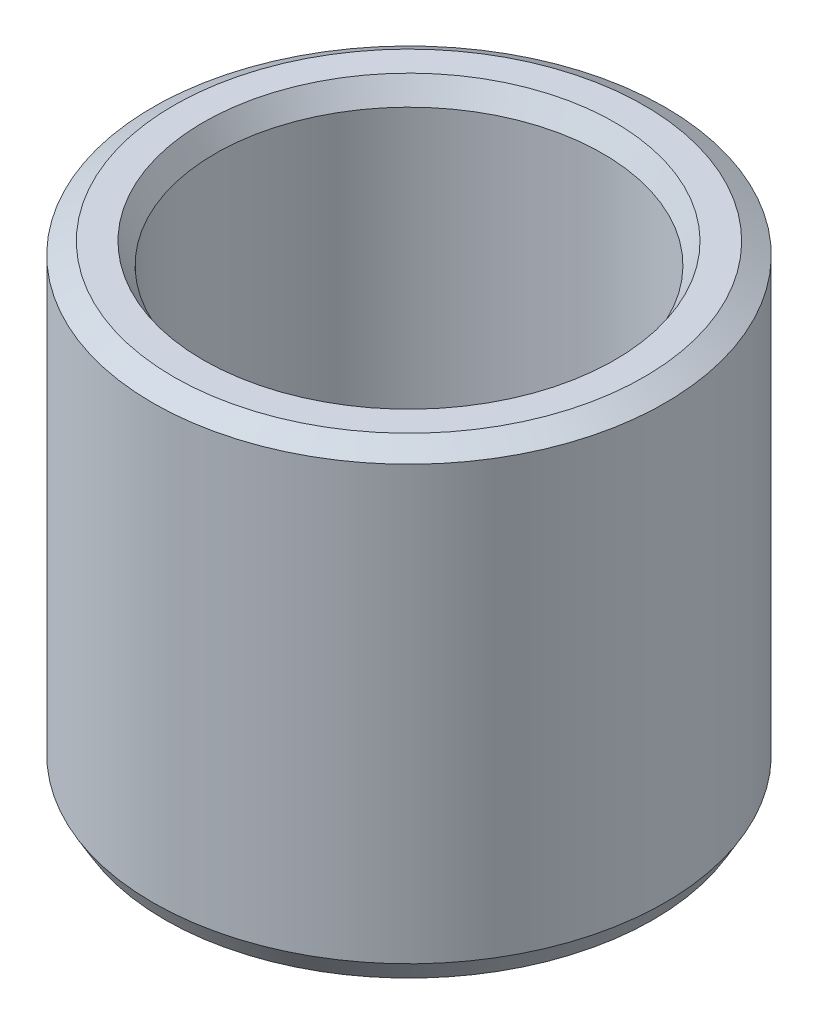
ISO-10303-21;
HEADER;
FILE_DESCRIPTION(('STEP AP214'),'2;1');
FILE_NAME('part.step','',(''),(''),'','','');
FILE_SCHEMA(('AUTOMOTIVE_DESIGN { 1 0 10303 214 1 1 1 1 }'));
ENDSEC;
DATA;
#1=APPLICATION_CONTEXT('core data for automotive mechanical design processes');
#2=APPLICATION_PROTOCOL_DEFINITION('international standard','automotive_design',2000,#1);
#3=PRODUCT_CONTEXT('',#1,'mechanical');
#4=PRODUCT('Part','Part','',(#3));
#5=PRODUCT_RELATED_PRODUCT_CATEGORY('part','',(#4));
#6=PRODUCT_DEFINITION_FORMATION('','',#4);
#7=PRODUCT_DEFINITION_CONTEXT('part definition',#1,'design');
#8=PRODUCT_DEFINITION('design','',#6,#7);
#9=PRODUCT_DEFINITION_SHAPE('','',#8);
#10=(LENGTH_UNIT() NAMED_UNIT(*) SI_UNIT(.MILLI.,.METRE.));
#11=(NAMED_UNIT(*) PLANE_ANGLE_UNIT() SI_UNIT($,.RADIAN.));
#12=(NAMED_UNIT(*) SI_UNIT($,.STERADIAN.) SOLID_ANGLE_UNIT());
#13=UNCERTAINTY_MEASURE_WITH_UNIT(LENGTH_MEASURE(1.E-05),#10,'distance_accuracy_value','');
#14=(GEOMETRIC_REPRESENTATION_CONTEXT(3) GLOBAL_UNCERTAINTY_ASSIGNED_CONTEXT((#13)) GLOBAL_UNIT_ASSIGNED_CONTEXT((#10,
#11,#12)) REPRESENTATION_CONTEXT('',''));
#15=CARTESIAN_POINT('',(0.,0.,0.));
#16=DIRECTION('',(0.,0.,1.));
#17=DIRECTION('',(1.,0.,0.));
#18=AXIS2_PLACEMENT_3D('',#15,#16,#17);
#19=CARTESIAN_POINT('',(0.,40.8984740167716,0.));
#20=DIRECTION('',(0.,-1.,0.));
#21=DIRECTION('',(0.,0.,-1.));
#22=AXIS2_PLACEMENT_3D('',#19,#20,#21);
#23=CYLINDRICAL_SURFACE('',#22,22.5);
#24=CARTESIAN_POINT('',(0.,1.83808913504664,0.));
#25=DIRECTION('',(0.,1.,0.));
#26=DIRECTION('',(0.,0.,1.));
#27=AXIS2_PLACEMENT_3D('',#24,#25,#26);
#28=CIRCLE('',#27,22.5);
#29=CARTESIAN_POINT('',(0.,1.83808913504664,22.5));
#30=VERTEX_POINT('',#29);
#31=EDGE_CURVE('E10',#30,#30,#28,.T.);
#32=ORIENTED_EDGE('',*,*,#31,.T.);
#33=EDGE_LOOP('',(#32));
#34=FACE_BOUND('',#33,.T.);
#35=CARTESIAN_POINT('',(0.,39.8372527598579,0.));
#36=DIRECTION('',(0.,1.,0.));
#37=DIRECTION('',(0.,0.,1.));
#38=AXIS2_PLACEMENT_3D('',#35,#36,#37);
#39=CIRCLE('',#38,22.5);
#40=CARTESIAN_POINT('',(0.,39.8372527598579,22.5));
#41=VERTEX_POINT('',#40);
#42=EDGE_CURVE('E50',#41,#41,#39,.F.);
#43=ORIENTED_EDGE('',*,*,#42,.T.);
#44=EDGE_LOOP('',(#43));
#45=FACE_BOUND('',#44,.T.);
#46=ADVANCED_FACE('F39',(#34,#45),#23,.T.);
#47=CARTESIAN_POINT('',(0.,40.8984740167716,0.));
#48=DIRECTION('',(0.,1.,0.));
#49=DIRECTION('',(0.,0.,1.));
#50=AXIS2_PLACEMENT_3D('',#47,#48,#49);
#51=PLANE('',#50);
#52=CARTESIAN_POINT('',(0.,40.8984740167716,0.));
#53=DIRECTION('',(0.,1.,0.));
#54=DIRECTION('',(0.,0.,1.));
#55=AXIS2_PLACEMENT_3D('',#52,#53,#54);
#56=CIRCLE('',#55,18.0766781013463);
#57=CARTESIAN_POINT('',(0.,40.8984740167716,18.0766781013463));
#58=VERTEX_POINT('',#57);
#59=EDGE_CURVE('E58',#58,#58,#56,.F.);
#60=ORIENTED_EDGE('',*,*,#59,.T.);
#61=EDGE_LOOP('',(#60));
#62=FACE_BOUND('',#61,.T.);
#63=CARTESIAN_POINT('',(0.,40.8984740167716,0.));
#64=DIRECTION('',(0.,1.,0.));
#65=DIRECTION('',(0.,0.,1.));
#66=AXIS2_PLACEMENT_3D('',#63,#64,#65);
#67=CIRCLE('',#66,20.6619108649534);
#68=CARTESIAN_POINT('',(0.,40.8984740167716,20.6619108649534));
#69=VERTEX_POINT('',#68);
#70=EDGE_CURVE('E61',#69,#69,#67,.T.);
#71=ORIENTED_EDGE('',*,*,#70,.T.);
#72=EDGE_LOOP('',(#71));
#73=FACE_BOUND('',#72,.T.);
#74=ADVANCED_FACE('F88',(#62,#73),#51,.T.);
#75=CARTESIAN_POINT('',(0.,0.,0.));
#76=DIRECTION('',(0.,1.,0.));
#77=DIRECTION('',(0.,0.,1.));
#78=AXIS2_PLACEMENT_3D('',#75,#76,#77);
#79=PLANE('',#78);
#80=CARTESIAN_POINT('',(0.,0.,0.));
#81=DIRECTION('',(0.,1.,0.));
#82=DIRECTION('',(0.,0.,1.));
#83=AXIS2_PLACEMENT_3D('',#80,#81,#82);
#84=CIRCLE('',#83,18.8535459794792);
#85=CARTESIAN_POINT('',(0.,0.,18.8535459794792));
#86=VERTEX_POINT('',#85);
#87=EDGE_CURVE('E51',#86,#86,#84,.T.);
#88=ORIENTED_EDGE('',*,*,#87,.T.);
#89=EDGE_LOOP('',(#88));
#90=FACE_BOUND('',#89,.T.);
#91=CARTESIAN_POINT('',(0.,0.,0.));
#92=DIRECTION('',(0.,1.,0.));
#93=DIRECTION('',(0.,0.,1.));
#94=AXIS2_PLACEMENT_3D('',#91,#92,#93);
#95=CIRCLE('',#94,21.4387787430863);
#96=CARTESIAN_POINT('',(0.,0.,21.4387787430863));
#97=VERTEX_POINT('',#96);
#98=EDGE_CURVE('E54',#97,#97,#95,.F.);
#99=ORIENTED_EDGE('',*,*,#98,.T.);
#100=EDGE_LOOP('',(#99));
#101=FACE_BOUND('',#100,.T.);
#102=ADVANCED_FACE('F83',(#90,#101),#79,.F.);
#103=CARTESIAN_POINT('',(0.,40.8984740167716,0.));
#104=DIRECTION('',(0.,-1.,0.));
#105=DIRECTION('',(0.,0.,-1.));
#106=AXIS2_PLACEMENT_3D('',#103,#104,#105);
#107=CYLINDRICAL_SURFACE('',#106,17.0154568444326);
#108=CARTESIAN_POINT('',(0.,39.060384881725,0.));
#109=DIRECTION('',(0.,1.,0.));
#110=DIRECTION('',(0.,0.,1.));
#111=AXIS2_PLACEMENT_3D('',#108,#109,#110);
#112=CIRCLE('',#111,17.0154568444326);
#113=CARTESIAN_POINT('',(0.,39.060384881725,17.0154568444326));
#114=VERTEX_POINT('',#113);
#115=EDGE_CURVE('E67',#114,#114,#112,.T.);
#116=ORIENTED_EDGE('',*,*,#115,.T.);
#117=EDGE_LOOP('',(#116));
#118=FACE_BOUND('',#117,.T.);
#119=CARTESIAN_POINT('',(0.,1.06122125691371,0.));
#120=DIRECTION('',(0.,1.,0.));
#121=DIRECTION('',(0.,0.,1.));
#122=AXIS2_PLACEMENT_3D('',#119,#120,#121);
#123=CIRCLE('',#122,17.0154568444326);
#124=CARTESIAN_POINT('',(0.,1.06122125691371,17.0154568444326));
#125=VERTEX_POINT('',#124);
#126=EDGE_CURVE('E69',#125,#125,#123,.F.);
#127=ORIENTED_EDGE('',*,*,#126,.T.);
#128=EDGE_LOOP('',(#127));
#129=FACE_BOUND('',#128,.T.);
#130=ADVANCED_FACE('F71',(#118,#129),#107,.F.);
#131=CARTESIAN_POINT('',(0.,39.060384881725,0.));
#132=DIRECTION('',(0.,1.,0.));
#133=DIRECTION('',(0.,0.,1.));
#134=AXIS2_PLACEMENT_3D('',#131,#132,#133);
#135=CONICAL_SURFACE('',#134,17.0154568444326,0.523598775598304);
#136=ORIENTED_EDGE('',*,*,#59,.F.);
#137=EDGE_LOOP('',(#136));
#138=FACE_BOUND('',#137,.T.);
#139=ORIENTED_EDGE('',*,*,#115,.F.);
#140=EDGE_LOOP('',(#139));
#141=FACE_BOUND('',#140,.T.);
#142=ADVANCED_FACE('F77',(#138,#141),#135,.F.);
#143=CARTESIAN_POINT('',(0.,0.,0.));
#144=DIRECTION('',(0.,-1.,0.));
#145=DIRECTION('',(0.,0.,-1.));
#146=AXIS2_PLACEMENT_3D('',#143,#144,#145);
#147=CONICAL_SURFACE('',#146,18.8535459794792,1.04719755119659);
#148=ORIENTED_EDGE('',*,*,#126,.F.);
#149=EDGE_LOOP('',(#148));
#150=FACE_BOUND('',#149,.T.);
#151=ORIENTED_EDGE('',*,*,#87,.F.);
#152=EDGE_LOOP('',(#151));
#153=FACE_BOUND('',#152,.T.);
#154=ADVANCED_FACE('F73',(#150,#153),#147,.F.);
#155=CARTESIAN_POINT('',(0.,1.83808913504664,0.));
#156=DIRECTION('',(0.,1.,0.));
#157=DIRECTION('',(0.,0.,1.));
#158=AXIS2_PLACEMENT_3D('',#155,#156,#157);
#159=CONICAL_SURFACE('',#158,22.5,0.523598775598302);
#160=ORIENTED_EDGE('',*,*,#98,.F.);
#161=EDGE_LOOP('',(#160));
#162=FACE_BOUND('',#161,.T.);
#163=ORIENTED_EDGE('',*,*,#31,.F.);
#164=EDGE_LOOP('',(#163));
#165=FACE_BOUND('',#164,.T.);
#166=ADVANCED_FACE('F76',(#162,#165),#159,.T.);
#167=CARTESIAN_POINT('',(0.,40.8984740167716,0.));
#168=DIRECTION('',(0.,-1.,0.));
#169=DIRECTION('',(0.,0.,-1.));
#170=AXIS2_PLACEMENT_3D('',#167,#168,#169);
#171=CONICAL_SURFACE('',#170,20.6619108649534,1.04719755119659);
#172=ORIENTED_EDGE('',*,*,#42,.F.);
#173=EDGE_LOOP('',(#172));
#174=FACE_BOUND('',#173,.T.);
#175=ORIENTED_EDGE('',*,*,#70,.F.);
#176=EDGE_LOOP('',(#175));
#177=FACE_BOUND('',#176,.T.);
#178=ADVANCED_FACE('F45',(#174,#177),#171,.T.);
#179=CLOSED_SHELL('',(#46,#74,#102,#130,#142,#154,#166,#178));
#180=MANIFOLD_SOLID_BREP('B2',#179);
#181=ADVANCED_BREP_SHAPE_REPRESENTATION('',(#18,#180),#14);
#182=SHAPE_DEFINITION_REPRESENTATION(#9,#181);
ENDSEC;
END-ISO-10303-21;
